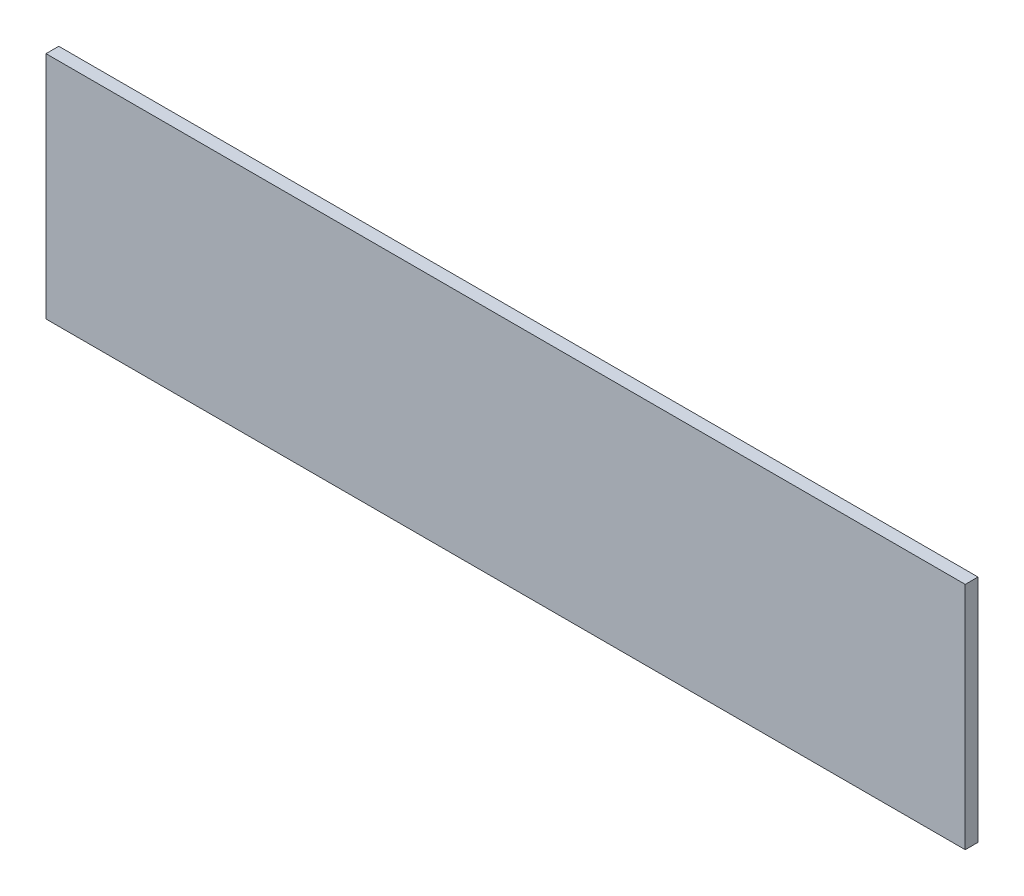
ISO-10303-21;
HEADER;
FILE_DESCRIPTION(('STEP AP214'),'2;1');
FILE_NAME('part.step','',(''),(''),'','','');
FILE_SCHEMA(('AUTOMOTIVE_DESIGN { 1 0 10303 214 1 1 1 1 }'));
ENDSEC;
DATA;
#1=APPLICATION_CONTEXT('core data for automotive mechanical design processes');
#2=APPLICATION_PROTOCOL_DEFINITION('international standard','automotive_design',2000,#1);
#3=PRODUCT_CONTEXT('',#1,'mechanical');
#4=PRODUCT('Part','Part','',(#3));
#5=PRODUCT_RELATED_PRODUCT_CATEGORY('part','',(#4));
#6=PRODUCT_DEFINITION_FORMATION('','',#4);
#7=PRODUCT_DEFINITION_CONTEXT('part definition',#1,'design');
#8=PRODUCT_DEFINITION('design','',#6,#7);
#9=PRODUCT_DEFINITION_SHAPE('','',#8);
#10=(LENGTH_UNIT() NAMED_UNIT(*) SI_UNIT(.MILLI.,.METRE.));
#11=(NAMED_UNIT(*) PLANE_ANGLE_UNIT() SI_UNIT($,.RADIAN.));
#12=(NAMED_UNIT(*) SI_UNIT($,.STERADIAN.) SOLID_ANGLE_UNIT());
#13=UNCERTAINTY_MEASURE_WITH_UNIT(LENGTH_MEASURE(1.E-05),#10,'distance_accuracy_value','');
#14=(GEOMETRIC_REPRESENTATION_CONTEXT(3) GLOBAL_UNCERTAINTY_ASSIGNED_CONTEXT((#13)) GLOBAL_UNIT_ASSIGNED_CONTEXT((#10,
#11,#12)) REPRESENTATION_CONTEXT('',''));
#15=CARTESIAN_POINT('',(0.,0.,0.));
#16=DIRECTION('',(0.,0.,1.));
#17=DIRECTION('',(1.,0.,0.));
#18=AXIS2_PLACEMENT_3D('',#15,#16,#17);
#19=CARTESIAN_POINT('',(160.,45.,5.));
#20=DIRECTION('',(-1.,0.,0.));
#21=DIRECTION('',(0.,0.,1.));
#22=AXIS2_PLACEMENT_3D('',#19,#20,#21);
#23=PLANE('',#22);
#24=DIRECTION('',(0.,1.,0.));
#25=VECTOR('',#24,1.);
#26=CARTESIAN_POINT('',(160.,45.,0.));
#27=LINE('',#26,#25);
#28=CARTESIAN_POINT('',(160.,-45.,0.));
#29=VERTEX_POINT('',#28);
#30=CARTESIAN_POINT('',(160.,45.,0.));
#31=VERTEX_POINT('',#30);
#32=EDGE_CURVE('E98',#29,#31,#27,.T.);
#33=ORIENTED_EDGE('',*,*,#32,.T.);
#34=DIRECTION('',(0.,0.,-1.));
#35=VECTOR('',#34,1.);
#36=CARTESIAN_POINT('',(160.,45.,5.));
#37=LINE('',#36,#35);
#38=CARTESIAN_POINT('',(160.,45.,5.));
#39=VERTEX_POINT('',#38);
#40=EDGE_CURVE('E11',#39,#31,#37,.T.);
#41=ORIENTED_EDGE('',*,*,#40,.F.);
#42=DIRECTION('',(0.,1.,0.));
#43=VECTOR('',#42,1.);
#44=CARTESIAN_POINT('',(160.,45.,5.));
#45=LINE('',#44,#43);
#46=CARTESIAN_POINT('',(160.,-45.,5.));
#47=VERTEX_POINT('',#46);
#48=EDGE_CURVE('E86',#47,#39,#45,.T.);
#49=ORIENTED_EDGE('',*,*,#48,.F.);
#50=DIRECTION('',(0.,0.,-1.));
#51=VECTOR('',#50,1.);
#52=CARTESIAN_POINT('',(160.,-45.,5.));
#53=LINE('',#52,#51);
#54=EDGE_CURVE('E94',#47,#29,#53,.T.);
#55=ORIENTED_EDGE('',*,*,#54,.T.);
#56=EDGE_LOOP('',(#33,#41,#49,#55));
#57=FACE_BOUND('',#56,.T.);
#58=ADVANCED_FACE('F35',(#57),#23,.F.);
#59=CARTESIAN_POINT('',(-200.,45.,5.));
#60=DIRECTION('',(0.,-1.,0.));
#61=DIRECTION('',(0.,0.,-1.));
#62=AXIS2_PLACEMENT_3D('',#59,#60,#61);
#63=PLANE('',#62);
#64=DIRECTION('',(-1.,0.,0.));
#65=VECTOR('',#64,1.);
#66=CARTESIAN_POINT('',(-200.,45.,0.));
#67=LINE('',#66,#65);
#68=CARTESIAN_POINT('',(-200.,45.,0.));
#69=VERTEX_POINT('',#68);
#70=EDGE_CURVE('E90',#31,#69,#67,.T.);
#71=ORIENTED_EDGE('',*,*,#70,.T.);
#72=DIRECTION('',(0.,0.,-1.));
#73=VECTOR('',#72,1.);
#74=CARTESIAN_POINT('',(-200.,45.,5.));
#75=LINE('',#74,#73);
#76=CARTESIAN_POINT('',(-200.,45.,5.));
#77=VERTEX_POINT('',#76);
#78=EDGE_CURVE('E43',#77,#69,#75,.T.);
#79=ORIENTED_EDGE('',*,*,#78,.F.);
#80=DIRECTION('',(-1.,0.,0.));
#81=VECTOR('',#80,1.);
#82=CARTESIAN_POINT('',(-200.,45.,5.));
#83=LINE('',#82,#81);
#84=EDGE_CURVE('E81',#39,#77,#83,.T.);
#85=ORIENTED_EDGE('',*,*,#84,.F.);
#86=ORIENTED_EDGE('',*,*,#40,.T.);
#87=EDGE_LOOP('',(#71,#79,#85,#86));
#88=FACE_BOUND('',#87,.T.);
#89=ADVANCED_FACE('F89',(#88),#63,.F.);
#90=CARTESIAN_POINT('',(-200.,45.,5.));
#91=DIRECTION('',(1.,0.,0.));
#92=DIRECTION('',(0.,0.,-1.));
#93=AXIS2_PLACEMENT_3D('',#90,#91,#92);
#94=PLANE('',#93);
#95=DIRECTION('',(0.,-1.,0.));
#96=VECTOR('',#95,1.);
#97=CARTESIAN_POINT('',(-200.,45.,0.));
#98=LINE('',#97,#96);
#99=CARTESIAN_POINT('',(-200.,-45.,0.));
#100=VERTEX_POINT('',#99);
#101=EDGE_CURVE('E68',#69,#100,#98,.T.);
#102=ORIENTED_EDGE('',*,*,#101,.T.);
#103=DIRECTION('',(0.,0.,-1.));
#104=VECTOR('',#103,1.);
#105=CARTESIAN_POINT('',(-200.,-45.,5.));
#106=LINE('',#105,#104);
#107=CARTESIAN_POINT('',(-200.,-45.,5.));
#108=VERTEX_POINT('',#107);
#109=EDGE_CURVE('E91',#108,#100,#106,.T.);
#110=ORIENTED_EDGE('',*,*,#109,.F.);
#111=DIRECTION('',(0.,-1.,0.));
#112=VECTOR('',#111,1.);
#113=CARTESIAN_POINT('',(-200.,45.,5.));
#114=LINE('',#113,#112);
#115=EDGE_CURVE('E84',#77,#108,#114,.T.);
#116=ORIENTED_EDGE('',*,*,#115,.F.);
#117=ORIENTED_EDGE('',*,*,#78,.T.);
#118=EDGE_LOOP('',(#102,#110,#116,#117));
#119=FACE_BOUND('',#118,.T.);
#120=ADVANCED_FACE('F92',(#119),#94,.F.);
#121=CARTESIAN_POINT('',(-200.,-45.,5.));
#122=DIRECTION('',(0.,1.,0.));
#123=DIRECTION('',(0.,0.,1.));
#124=AXIS2_PLACEMENT_3D('',#121,#122,#123);
#125=PLANE('',#124);
#126=DIRECTION('',(1.,0.,0.));
#127=VECTOR('',#126,1.);
#128=CARTESIAN_POINT('',(-200.,-45.,0.));
#129=LINE('',#128,#127);
#130=EDGE_CURVE('E74',#100,#29,#129,.T.);
#131=ORIENTED_EDGE('',*,*,#130,.T.);
#132=ORIENTED_EDGE('',*,*,#54,.F.);
#133=DIRECTION('',(1.,0.,0.));
#134=VECTOR('',#133,1.);
#135=CARTESIAN_POINT('',(-200.,-45.,5.));
#136=LINE('',#135,#134);
#137=EDGE_CURVE('E51',#108,#47,#136,.T.);
#138=ORIENTED_EDGE('',*,*,#137,.F.);
#139=ORIENTED_EDGE('',*,*,#109,.T.);
#140=EDGE_LOOP('',(#131,#132,#138,#139));
#141=FACE_BOUND('',#140,.T.);
#142=ADVANCED_FACE('F105',(#141),#125,.F.);
#143=CARTESIAN_POINT('',(0.,0.,5.));
#144=DIRECTION('',(0.,0.,1.));
#145=DIRECTION('',(1.,0.,0.));
#146=AXIS2_PLACEMENT_3D('',#143,#144,#145);
#147=PLANE('',#146);
#148=ORIENTED_EDGE('',*,*,#48,.T.);
#149=ORIENTED_EDGE('',*,*,#84,.T.);
#150=ORIENTED_EDGE('',*,*,#115,.T.);
#151=ORIENTED_EDGE('',*,*,#137,.T.);
#152=EDGE_LOOP('',(#148,#149,#150,#151));
#153=FACE_BOUND('',#152,.T.);
#154=ADVANCED_FACE('F82',(#153),#147,.T.);
#155=CARTESIAN_POINT('',(0.,0.,0.));
#156=DIRECTION('',(0.,0.,1.));
#157=DIRECTION('',(1.,0.,0.));
#158=AXIS2_PLACEMENT_3D('',#155,#156,#157);
#159=PLANE('',#158);
#160=ORIENTED_EDGE('',*,*,#32,.F.);
#161=ORIENTED_EDGE('',*,*,#130,.F.);
#162=ORIENTED_EDGE('',*,*,#101,.F.);
#163=ORIENTED_EDGE('',*,*,#70,.F.);
#164=EDGE_LOOP('',(#160,#161,#162,#163));
#165=FACE_BOUND('',#164,.T.);
#166=ADVANCED_FACE('F108',(#165),#159,.F.);
#167=CLOSED_SHELL('',(#58,#89,#120,#142,#154,#166));
#168=MANIFOLD_SOLID_BREP('B2',#167);
#169=ADVANCED_BREP_SHAPE_REPRESENTATION('',(#18,#168),#14);
#170=SHAPE_DEFINITION_REPRESENTATION(#9,#169);
ENDSEC;
END-ISO-10303-21;
